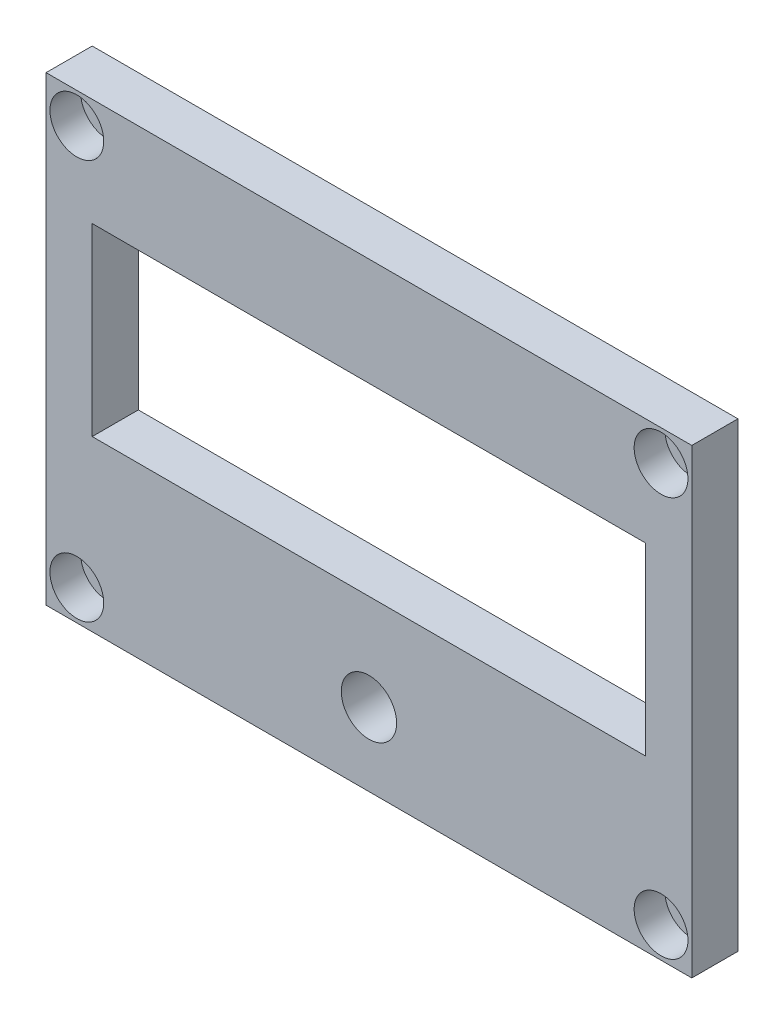
ISO-10303-21;
HEADER;
FILE_DESCRIPTION(('STEP AP214'),'2;1');
FILE_NAME('part.step','',(''),(''),'','','');
FILE_SCHEMA(('AUTOMOTIVE_DESIGN { 1 0 10303 214 1 1 1 1 }'));
ENDSEC;
DATA;
#1=APPLICATION_CONTEXT('core data for automotive mechanical design processes');
#2=APPLICATION_PROTOCOL_DEFINITION('international standard','automotive_design',2000,#1);
#3=PRODUCT_CONTEXT('',#1,'mechanical');
#4=PRODUCT('Part','Part','',(#3));
#5=PRODUCT_RELATED_PRODUCT_CATEGORY('part','',(#4));
#6=PRODUCT_DEFINITION_FORMATION('','',#4);
#7=PRODUCT_DEFINITION_CONTEXT('part definition',#1,'design');
#8=PRODUCT_DEFINITION('design','',#6,#7);
#9=PRODUCT_DEFINITION_SHAPE('','',#8);
#10=(LENGTH_UNIT() NAMED_UNIT(*) SI_UNIT(.MILLI.,.METRE.));
#11=(NAMED_UNIT(*) PLANE_ANGLE_UNIT() SI_UNIT($,.RADIAN.));
#12=(NAMED_UNIT(*) SI_UNIT($,.STERADIAN.) SOLID_ANGLE_UNIT());
#13=UNCERTAINTY_MEASURE_WITH_UNIT(LENGTH_MEASURE(1.E-05),#10,'distance_accuracy_value','');
#14=(GEOMETRIC_REPRESENTATION_CONTEXT(3) GLOBAL_UNCERTAINTY_ASSIGNED_CONTEXT((#13)) GLOBAL_UNIT_ASSIGNED_CONTEXT((#10,
#11,#12)) REPRESENTATION_CONTEXT('',''));
#15=CARTESIAN_POINT('',(0.,0.,0.));
#16=DIRECTION('',(0.,0.,1.));
#17=DIRECTION('',(1.,0.,0.));
#18=AXIS2_PLACEMENT_3D('',#15,#16,#17);
#19=CARTESIAN_POINT('',(-37.,30.,6.));
#20=DIRECTION('',(0.,-1.,0.));
#21=DIRECTION('',(0.,0.,-1.));
#22=AXIS2_PLACEMENT_3D('',#19,#20,#21);
#23=PLANE('',#22);
#24=DIRECTION('',(-1.,0.,0.));
#25=VECTOR('',#24,1.);
#26=CARTESIAN_POINT('',(-37.,30.,0.));
#27=LINE('',#26,#25);
#28=CARTESIAN_POINT('',(44.,30.,0.));
#29=VERTEX_POINT('',#28);
#30=CARTESIAN_POINT('',(-40.,30.,0.));
#31=VERTEX_POINT('',#30);
#32=EDGE_CURVE('E172',#29,#31,#27,.T.);
#33=ORIENTED_EDGE('',*,*,#32,.T.);
#34=DIRECTION('',(0.,0.,-1.));
#35=VECTOR('',#34,1.);
#36=CARTESIAN_POINT('',(-40.,30.,6.));
#37=LINE('',#36,#35);
#38=CARTESIAN_POINT('',(-40.,30.,6.));
#39=VERTEX_POINT('',#38);
#40=EDGE_CURVE('E44',#39,#31,#37,.T.);
#41=ORIENTED_EDGE('',*,*,#40,.F.);
#42=DIRECTION('',(-1.,0.,0.));
#43=VECTOR('',#42,1.);
#44=CARTESIAN_POINT('',(37.,30.,6.));
#45=LINE('',#44,#43);
#46=CARTESIAN_POINT('',(44.,30.,6.));
#47=VERTEX_POINT('',#46);
#48=EDGE_CURVE('E178',#47,#39,#45,.T.);
#49=ORIENTED_EDGE('',*,*,#48,.F.);
#50=DIRECTION('',(0.,0.,-1.));
#51=VECTOR('',#50,1.);
#52=CARTESIAN_POINT('',(44.,30.,6.));
#53=LINE('',#52,#51);
#54=EDGE_CURVE('E11',#47,#29,#53,.T.);
#55=ORIENTED_EDGE('',*,*,#54,.T.);
#56=EDGE_LOOP('',(#33,#41,#49,#55));
#57=FACE_BOUND('',#56,.T.);
#58=ADVANCED_FACE('F36',(#57),#23,.F.);
#59=CARTESIAN_POINT('',(-40.,-30.,6.));
#60=DIRECTION('',(1.,0.,0.));
#61=DIRECTION('',(0.,0.,-1.));
#62=AXIS2_PLACEMENT_3D('',#59,#60,#61);
#63=PLANE('',#62);
#64=DIRECTION('',(0.,-1.,0.));
#65=VECTOR('',#64,1.);
#66=CARTESIAN_POINT('',(-40.,-30.,0.));
#67=LINE('',#66,#65);
#68=CARTESIAN_POINT('',(-40.,-30.,0.));
#69=VERTEX_POINT('',#68);
#70=EDGE_CURVE('E188',#31,#69,#67,.T.);
#71=ORIENTED_EDGE('',*,*,#70,.T.);
#72=DIRECTION('',(0.,0.,-1.));
#73=VECTOR('',#72,1.);
#74=CARTESIAN_POINT('',(-40.,-30.,6.));
#75=LINE('',#74,#73);
#76=CARTESIAN_POINT('',(-40.,-30.,6.));
#77=VERTEX_POINT('',#76);
#78=EDGE_CURVE('E198',#77,#69,#75,.T.);
#79=ORIENTED_EDGE('',*,*,#78,.F.);
#80=DIRECTION('',(0.,-1.,0.));
#81=VECTOR('',#80,1.);
#82=CARTESIAN_POINT('',(-40.,30.,6.));
#83=LINE('',#82,#81);
#84=EDGE_CURVE('E181',#39,#77,#83,.T.);
#85=ORIENTED_EDGE('',*,*,#84,.F.);
#86=ORIENTED_EDGE('',*,*,#40,.T.);
#87=EDGE_LOOP('',(#71,#79,#85,#86));
#88=FACE_BOUND('',#87,.T.);
#89=ADVANCED_FACE('F246',(#88),#63,.F.);
#90=CARTESIAN_POINT('',(44.,-30.,6.));
#91=DIRECTION('',(0.,1.,0.));
#92=DIRECTION('',(0.,0.,1.));
#93=AXIS2_PLACEMENT_3D('',#90,#91,#92);
#94=PLANE('',#93);
#95=DIRECTION('',(1.,0.,0.));
#96=VECTOR('',#95,1.);
#97=CARTESIAN_POINT('',(44.,-30.,0.));
#98=LINE('',#97,#96);
#99=CARTESIAN_POINT('',(44.,-30.,0.));
#100=VERTEX_POINT('',#99);
#101=EDGE_CURVE('E191',#69,#100,#98,.T.);
#102=ORIENTED_EDGE('',*,*,#101,.T.);
#103=DIRECTION('',(0.,0.,-1.));
#104=VECTOR('',#103,1.);
#105=CARTESIAN_POINT('',(44.,-30.,6.));
#106=LINE('',#105,#104);
#107=CARTESIAN_POINT('',(44.,-30.,6.));
#108=VERTEX_POINT('',#107);
#109=EDGE_CURVE('E185',#108,#100,#106,.T.);
#110=ORIENTED_EDGE('',*,*,#109,.F.);
#111=DIRECTION('',(1.,0.,0.));
#112=VECTOR('',#111,1.);
#113=CARTESIAN_POINT('',(-37.,-30.,6.));
#114=LINE('',#113,#112);
#115=EDGE_CURVE('E183',#77,#108,#114,.T.);
#116=ORIENTED_EDGE('',*,*,#115,.F.);
#117=ORIENTED_EDGE('',*,*,#78,.T.);
#118=EDGE_LOOP('',(#102,#110,#116,#117));
#119=FACE_BOUND('',#118,.T.);
#120=ADVANCED_FACE('F248',(#119),#94,.F.);
#121=CARTESIAN_POINT('',(44.,-27.,6.));
#122=DIRECTION('',(-1.,0.,0.));
#123=DIRECTION('',(0.,0.,1.));
#124=AXIS2_PLACEMENT_3D('',#121,#122,#123);
#125=PLANE('',#124);
#126=DIRECTION('',(0.,1.,0.));
#127=VECTOR('',#126,1.);
#128=CARTESIAN_POINT('',(44.,-27.,0.));
#129=LINE('',#128,#127);
#130=EDGE_CURVE('E179',#100,#29,#129,.T.);
#131=ORIENTED_EDGE('',*,*,#130,.T.);
#132=ORIENTED_EDGE('',*,*,#54,.F.);
#133=DIRECTION('',(0.,1.,0.));
#134=VECTOR('',#133,1.);
#135=CARTESIAN_POINT('',(44.,30.,6.));
#136=LINE('',#135,#134);
#137=EDGE_CURVE('E175',#108,#47,#136,.T.);
#138=ORIENTED_EDGE('',*,*,#137,.F.);
#139=ORIENTED_EDGE('',*,*,#109,.T.);
#140=EDGE_LOOP('',(#131,#132,#138,#139));
#141=FACE_BOUND('',#140,.T.);
#142=ADVANCED_FACE('F233',(#141),#125,.F.);
#143=CARTESIAN_POINT('',(0.,0.,6.));
#144=DIRECTION('',(0.,0.,-1.));
#145=DIRECTION('',(-1.,0.,0.));
#146=AXIS2_PLACEMENT_3D('',#143,#144,#145);
#147=PLANE('',#146);
#148=CARTESIAN_POINT('',(1.99999999999999,-20.5,6.00000000000001));
#149=DIRECTION('',(0.,0.,-1.));
#150=DIRECTION('',(-1.,0.,0.));
#151=AXIS2_PLACEMENT_3D('',#148,#149,#150);
#152=CIRCLE('',#151,3.6);
#153=CARTESIAN_POINT('',(-1.6,-20.5,6.00000000000001));
#154=VERTEX_POINT('',#153);
#155=EDGE_CURVE('E146',#154,#154,#152,.F.);
#156=ORIENTED_EDGE('',*,*,#155,.F.);
#157=EDGE_LOOP('',(#156));
#158=FACE_BOUND('',#157,.T.);
#159=DIRECTION('',(1.,0.,0.));
#160=VECTOR('',#159,1.);
#161=CARTESIAN_POINT('',(-34.,-8.00000000000001,6.00000000000001));
#162=LINE('',#161,#160);
#163=CARTESIAN_POINT('',(-34.,-8.00000000000001,6.00000000000001));
#164=VERTEX_POINT('',#163);
#165=CARTESIAN_POINT('',(38.,-8.00000000000001,6.00000000000001));
#166=VERTEX_POINT('',#165);
#167=EDGE_CURVE('E570',#164,#166,#162,.T.);
#168=ORIENTED_EDGE('',*,*,#167,.F.);
#169=DIRECTION('',(0.,-1.,0.));
#170=VECTOR('',#169,1.);
#171=CARTESIAN_POINT('',(-34.,16.,6.00000000000001));
#172=LINE('',#171,#170);
#173=CARTESIAN_POINT('',(-34.,16.,6.00000000000001));
#174=VERTEX_POINT('',#173);
#175=EDGE_CURVE('E135',#174,#164,#172,.T.);
#176=ORIENTED_EDGE('',*,*,#175,.F.);
#177=DIRECTION('',(-1.,0.,0.));
#178=VECTOR('',#177,1.);
#179=CARTESIAN_POINT('',(1.99999999999999,16.,6.00000000000001));
#180=LINE('',#179,#178);
#181=CARTESIAN_POINT('',(38.,16.,6.));
#182=VERTEX_POINT('',#181);
#183=EDGE_CURVE('E132',#182,#174,#180,.T.);
#184=ORIENTED_EDGE('',*,*,#183,.F.);
#185=DIRECTION('',(0.,1.,0.));
#186=VECTOR('',#185,1.);
#187=CARTESIAN_POINT('',(38.,16.,6.00000000000001));
#188=LINE('',#187,#186);
#189=EDGE_CURVE('E108',#166,#182,#188,.T.);
#190=ORIENTED_EDGE('',*,*,#189,.F.);
#191=EDGE_LOOP('',(#168,#176,#184,#190));
#192=FACE_BOUND('',#191,.T.);
#193=CARTESIAN_POINT('',(-36.,-26.,6.));
#194=DIRECTION('',(0.,0.,1.));
#195=DIRECTION('',(-1.,0.,0.));
#196=AXIS2_PLACEMENT_3D('',#193,#194,#195);
#197=CIRCLE('',#196,3.5);
#198=CARTESIAN_POINT('',(-39.5,-26.,6.));
#199=VERTEX_POINT('',#198);
#200=EDGE_CURVE('E166',#199,#199,#197,.T.);
#201=ORIENTED_EDGE('',*,*,#200,.F.);
#202=EDGE_LOOP('',(#201));
#203=FACE_BOUND('',#202,.T.);
#204=CARTESIAN_POINT('',(40.,-26.,6.));
#205=DIRECTION('',(0.,0.,1.));
#206=DIRECTION('',(1.,0.,0.));
#207=AXIS2_PLACEMENT_3D('',#204,#205,#206);
#208=CIRCLE('',#207,3.5);
#209=CARTESIAN_POINT('',(43.5,-26.,6.));
#210=VERTEX_POINT('',#209);
#211=EDGE_CURVE('E160',#210,#210,#208,.T.);
#212=ORIENTED_EDGE('',*,*,#211,.F.);
#213=EDGE_LOOP('',(#212));
#214=FACE_BOUND('',#213,.T.);
#215=CARTESIAN_POINT('',(40.,26.,6.));
#216=DIRECTION('',(0.,0.,1.));
#217=DIRECTION('',(-1.,0.,0.));
#218=AXIS2_PLACEMENT_3D('',#215,#216,#217);
#219=CIRCLE('',#218,3.5);
#220=CARTESIAN_POINT('',(36.5,26.,6.));
#221=VERTEX_POINT('',#220);
#222=EDGE_CURVE('E154',#221,#221,#219,.T.);
#223=ORIENTED_EDGE('',*,*,#222,.F.);
#224=EDGE_LOOP('',(#223));
#225=FACE_BOUND('',#224,.T.);
#226=CARTESIAN_POINT('',(-36.,26.,6.));
#227=DIRECTION('',(0.,0.,1.));
#228=DIRECTION('',(1.,0.,0.));
#229=AXIS2_PLACEMENT_3D('',#226,#227,#228);
#230=CIRCLE('',#229,3.5);
#231=CARTESIAN_POINT('',(-32.5,26.,6.));
#232=VERTEX_POINT('',#231);
#233=EDGE_CURVE('E153',#232,#232,#230,.T.);
#234=ORIENTED_EDGE('',*,*,#233,.F.);
#235=EDGE_LOOP('',(#234));
#236=FACE_BOUND('',#235,.T.);
#237=ORIENTED_EDGE('',*,*,#137,.T.);
#238=ORIENTED_EDGE('',*,*,#48,.T.);
#239=ORIENTED_EDGE('',*,*,#84,.T.);
#240=ORIENTED_EDGE('',*,*,#115,.T.);
#241=EDGE_LOOP('',(#237,#238,#239,#240));
#242=FACE_BOUND('',#241,.T.);
#243=ADVANCED_FACE('F230',(#158,#192,#203,#214,#225,#236,#242),#147,.F.);
#244=CARTESIAN_POINT('',(0.,0.,0.));
#245=DIRECTION('',(0.,0.,-1.));
#246=DIRECTION('',(-1.,0.,0.));
#247=AXIS2_PLACEMENT_3D('',#244,#245,#246);
#248=PLANE('',#247);
#249=CARTESIAN_POINT('',(-36.,-12.,0.));
#250=DIRECTION('',(0.,0.,-1.));
#251=DIRECTION('',(-1.,0.,0.));
#252=AXIS2_PLACEMENT_3D('',#249,#250,#251);
#253=CIRCLE('',#252,1.5);
#254=CARTESIAN_POINT('',(-37.5,-12.,0.));
#255=VERTEX_POINT('',#254);
#256=EDGE_CURVE('E550',#255,#255,#253,.T.);
#257=ORIENTED_EDGE('',*,*,#256,.F.);
#258=EDGE_LOOP('',(#257));
#259=FACE_BOUND('',#258,.T.);
#260=CARTESIAN_POINT('',(40.,-12.,0.));
#261=DIRECTION('',(0.,0.,-1.));
#262=DIRECTION('',(-1.,0.,0.));
#263=AXIS2_PLACEMENT_3D('',#260,#261,#262);
#264=CIRCLE('',#263,1.5);
#265=CARTESIAN_POINT('',(38.5,-12.,0.));
#266=VERTEX_POINT('',#265);
#267=EDGE_CURVE('E549',#266,#266,#264,.T.);
#268=ORIENTED_EDGE('',*,*,#267,.F.);
#269=EDGE_LOOP('',(#268));
#270=FACE_BOUND('',#269,.T.);
#271=CARTESIAN_POINT('',(40.,20.,0.));
#272=DIRECTION('',(0.,0.,-1.));
#273=DIRECTION('',(-1.,0.,0.));
#274=AXIS2_PLACEMENT_3D('',#271,#272,#273);
#275=CIRCLE('',#274,1.5);
#276=CARTESIAN_POINT('',(38.5,20.,0.));
#277=VERTEX_POINT('',#276);
#278=EDGE_CURVE('E582',#277,#277,#275,.T.);
#279=ORIENTED_EDGE('',*,*,#278,.F.);
#280=EDGE_LOOP('',(#279));
#281=FACE_BOUND('',#280,.T.);
#282=CARTESIAN_POINT('',(-36.,20.,0.));
#283=DIRECTION('',(0.,0.,-1.));
#284=DIRECTION('',(-1.,0.,0.));
#285=AXIS2_PLACEMENT_3D('',#282,#283,#284);
#286=CIRCLE('',#285,1.5);
#287=CARTESIAN_POINT('',(-37.5,20.,0.));
#288=VERTEX_POINT('',#287);
#289=EDGE_CURVE('E561',#288,#288,#286,.T.);
#290=ORIENTED_EDGE('',*,*,#289,.F.);
#291=EDGE_LOOP('',(#290));
#292=FACE_BOUND('',#291,.T.);
#293=CARTESIAN_POINT('',(1.99999999999999,-20.5,0.));
#294=DIRECTION('',(0.,0.,-1.));
#295=DIRECTION('',(-1.,0.,0.));
#296=AXIS2_PLACEMENT_3D('',#293,#294,#295);
#297=CIRCLE('',#296,3.6);
#298=CARTESIAN_POINT('',(-1.6,-20.5,0.));
#299=VERTEX_POINT('',#298);
#300=EDGE_CURVE('E134',#299,#299,#297,.T.);
#301=ORIENTED_EDGE('',*,*,#300,.F.);
#302=EDGE_LOOP('',(#301));
#303=FACE_BOUND('',#302,.T.);
#304=DIRECTION('',(0.,1.,0.));
#305=VECTOR('',#304,1.);
#306=CARTESIAN_POINT('',(-34.,16.,0.));
#307=LINE('',#306,#305);
#308=CARTESIAN_POINT('',(-34.,-8.00000000000001,0.));
#309=VERTEX_POINT('',#308);
#310=CARTESIAN_POINT('',(-34.,16.,0.));
#311=VERTEX_POINT('',#310);
#312=EDGE_CURVE('E60',#309,#311,#307,.T.);
#313=ORIENTED_EDGE('',*,*,#312,.F.);
#314=DIRECTION('',(-1.,0.,0.));
#315=VECTOR('',#314,1.);
#316=CARTESIAN_POINT('',(-34.,-8.00000000000001,0.));
#317=LINE('',#316,#315);
#318=CARTESIAN_POINT('',(38.,-8.00000000000001,0.));
#319=VERTEX_POINT('',#318);
#320=EDGE_CURVE('E122',#319,#309,#317,.T.);
#321=ORIENTED_EDGE('',*,*,#320,.F.);
#322=DIRECTION('',(0.,-1.,0.));
#323=VECTOR('',#322,1.);
#324=CARTESIAN_POINT('',(38.,16.,0.));
#325=LINE('',#324,#323);
#326=CARTESIAN_POINT('',(38.,16.,0.));
#327=VERTEX_POINT('',#326);
#328=EDGE_CURVE('E105',#327,#319,#325,.T.);
#329=ORIENTED_EDGE('',*,*,#328,.F.);
#330=DIRECTION('',(1.,0.,0.));
#331=VECTOR('',#330,1.);
#332=CARTESIAN_POINT('',(1.99999999999999,16.,0.));
#333=LINE('',#332,#331);
#334=EDGE_CURVE('E113',#311,#327,#333,.T.);
#335=ORIENTED_EDGE('',*,*,#334,.F.);
#336=EDGE_LOOP('',(#313,#321,#329,#335));
#337=FACE_BOUND('',#336,.T.);
#338=CARTESIAN_POINT('',(-36.,-26.,0.));
#339=DIRECTION('',(0.,0.,-1.));
#340=DIRECTION('',(-1.,0.,0.));
#341=AXIS2_PLACEMENT_3D('',#338,#339,#340);
#342=CIRCLE('',#341,2.);
#343=CARTESIAN_POINT('',(-38.,-26.,0.));
#344=VERTEX_POINT('',#343);
#345=EDGE_CURVE('E143',#344,#344,#342,.F.);
#346=ORIENTED_EDGE('',*,*,#345,.T.);
#347=EDGE_LOOP('',(#346));
#348=FACE_BOUND('',#347,.T.);
#349=CARTESIAN_POINT('',(40.,-26.,0.));
#350=DIRECTION('',(0.,0.,-1.));
#351=DIRECTION('',(-1.,0.,0.));
#352=AXIS2_PLACEMENT_3D('',#349,#350,#351);
#353=CIRCLE('',#352,2.);
#354=CARTESIAN_POINT('',(38.,-26.,0.));
#355=VERTEX_POINT('',#354);
#356=EDGE_CURVE('E140',#355,#355,#353,.F.);
#357=ORIENTED_EDGE('',*,*,#356,.T.);
#358=EDGE_LOOP('',(#357));
#359=FACE_BOUND('',#358,.T.);
#360=CARTESIAN_POINT('',(40.,26.,0.));
#361=DIRECTION('',(0.,0.,-1.));
#362=DIRECTION('',(-1.,0.,0.));
#363=AXIS2_PLACEMENT_3D('',#360,#361,#362);
#364=CIRCLE('',#363,2.);
#365=CARTESIAN_POINT('',(38.,26.,0.));
#366=VERTEX_POINT('',#365);
#367=EDGE_CURVE('E136',#366,#366,#364,.F.);
#368=ORIENTED_EDGE('',*,*,#367,.T.);
#369=EDGE_LOOP('',(#368));
#370=FACE_BOUND('',#369,.T.);
#371=CARTESIAN_POINT('',(-36.,26.,0.));
#372=DIRECTION('',(0.,0.,-1.));
#373=DIRECTION('',(-1.,0.,0.));
#374=AXIS2_PLACEMENT_3D('',#371,#372,#373);
#375=CIRCLE('',#374,2.);
#376=CARTESIAN_POINT('',(-38.,26.,0.));
#377=VERTEX_POINT('',#376);
#378=EDGE_CURVE('E139',#377,#377,#375,.F.);
#379=ORIENTED_EDGE('',*,*,#378,.T.);
#380=EDGE_LOOP('',(#379));
#381=FACE_BOUND('',#380,.T.);
#382=ORIENTED_EDGE('',*,*,#32,.F.);
#383=ORIENTED_EDGE('',*,*,#130,.F.);
#384=ORIENTED_EDGE('',*,*,#101,.F.);
#385=ORIENTED_EDGE('',*,*,#70,.F.);
#386=EDGE_LOOP('',(#382,#383,#384,#385));
#387=FACE_BOUND('',#386,.T.);
#388=ADVANCED_FACE('F119',(#259,#270,#281,#292,#303,#337,#348,#359,#370,#381,#387),#248,.T.);
#389=CARTESIAN_POINT('',(-36.,26.,2.));
#390=DIRECTION('',(0.,0.,1.));
#391=DIRECTION('',(1.,0.,0.));
#392=AXIS2_PLACEMENT_3D('',#389,#390,#391);
#393=CYLINDRICAL_SURFACE('',#392,3.5);
#394=CARTESIAN_POINT('',(-36.,26.,2.));
#395=DIRECTION('',(0.,0.,1.));
#396=DIRECTION('',(1.,0.,0.));
#397=AXIS2_PLACEMENT_3D('',#394,#395,#396);
#398=CIRCLE('',#397,3.5);
#399=CARTESIAN_POINT('',(-32.5,26.,2.));
#400=VERTEX_POINT('',#399);
#401=EDGE_CURVE('E169',#400,#400,#398,.T.);
#402=ORIENTED_EDGE('',*,*,#401,.F.);
#403=EDGE_LOOP('',(#402));
#404=FACE_BOUND('',#403,.T.);
#405=ORIENTED_EDGE('',*,*,#233,.T.);
#406=EDGE_LOOP('',(#405));
#407=FACE_BOUND('',#406,.T.);
#408=ADVANCED_FACE('F221',(#404,#407),#393,.F.);
#409=CARTESIAN_POINT('',(-36.,26.,2.));
#410=DIRECTION('',(0.,0.,1.));
#411=DIRECTION('',(1.,0.,0.));
#412=AXIS2_PLACEMENT_3D('',#409,#410,#411);
#413=PLANE('',#412);
#414=CARTESIAN_POINT('',(-36.,26.,2.));
#415=DIRECTION('',(0.,0.,1.));
#416=DIRECTION('',(1.,0.,0.));
#417=AXIS2_PLACEMENT_3D('',#414,#415,#416);
#418=CIRCLE('',#417,2.);
#419=CARTESIAN_POINT('',(-34.,26.,2.));
#420=VERTEX_POINT('',#419);
#421=EDGE_CURVE('E39',#420,#420,#418,.T.);
#422=ORIENTED_EDGE('',*,*,#421,.F.);
#423=EDGE_LOOP('',(#422));
#424=FACE_BOUND('',#423,.T.);
#425=ORIENTED_EDGE('',*,*,#401,.T.);
#426=EDGE_LOOP('',(#425));
#427=FACE_BOUND('',#426,.T.);
#428=ADVANCED_FACE('F217',(#424,#427),#413,.T.);
#429=CARTESIAN_POINT('',(40.,26.,2.));
#430=DIRECTION('',(0.,0.,1.));
#431=DIRECTION('',(1.,0.,0.));
#432=AXIS2_PLACEMENT_3D('',#429,#430,#431);
#433=CYLINDRICAL_SURFACE('',#432,3.5);
#434=CARTESIAN_POINT('',(40.,26.,2.));
#435=DIRECTION('',(0.,0.,1.));
#436=DIRECTION('',(-1.,0.,0.));
#437=AXIS2_PLACEMENT_3D('',#434,#435,#436);
#438=CIRCLE('',#437,3.5);
#439=CARTESIAN_POINT('',(36.5,26.,2.));
#440=VERTEX_POINT('',#439);
#441=EDGE_CURVE('E150',#440,#440,#438,.T.);
#442=ORIENTED_EDGE('',*,*,#441,.F.);
#443=EDGE_LOOP('',(#442));
#444=FACE_BOUND('',#443,.T.);
#445=ORIENTED_EDGE('',*,*,#222,.T.);
#446=EDGE_LOOP('',(#445));
#447=FACE_BOUND('',#446,.T.);
#448=ADVANCED_FACE('F220',(#444,#447),#433,.F.);
#449=CARTESIAN_POINT('',(40.,26.,2.));
#450=DIRECTION('',(0.,0.,-1.));
#451=DIRECTION('',(-1.,0.,0.));
#452=AXIS2_PLACEMENT_3D('',#449,#450,#451);
#453=PLANE('',#452);
#454=CARTESIAN_POINT('',(40.,26.,2.));
#455=DIRECTION('',(0.,0.,-1.));
#456=DIRECTION('',(-1.,0.,0.));
#457=AXIS2_PLACEMENT_3D('',#454,#455,#456);
#458=CIRCLE('',#457,2.);
#459=CARTESIAN_POINT('',(38.,26.,2.));
#460=VERTEX_POINT('',#459);
#461=EDGE_CURVE('E207',#460,#460,#458,.T.);
#462=ORIENTED_EDGE('',*,*,#461,.T.);
#463=EDGE_LOOP('',(#462));
#464=FACE_BOUND('',#463,.T.);
#465=ORIENTED_EDGE('',*,*,#441,.T.);
#466=EDGE_LOOP('',(#465));
#467=FACE_BOUND('',#466,.T.);
#468=ADVANCED_FACE('F434',(#464,#467),#453,.F.);
#469=CARTESIAN_POINT('',(40.,-26.,2.));
#470=DIRECTION('',(0.,0.,1.));
#471=DIRECTION('',(1.,0.,0.));
#472=AXIS2_PLACEMENT_3D('',#469,#470,#471);
#473=CYLINDRICAL_SURFACE('',#472,3.5);
#474=CARTESIAN_POINT('',(40.,-26.,2.));
#475=DIRECTION('',(0.,0.,1.));
#476=DIRECTION('',(1.,0.,0.));
#477=AXIS2_PLACEMENT_3D('',#474,#475,#476);
#478=CIRCLE('',#477,3.5);
#479=CARTESIAN_POINT('',(43.5,-26.,2.));
#480=VERTEX_POINT('',#479);
#481=EDGE_CURVE('E157',#480,#480,#478,.T.);
#482=ORIENTED_EDGE('',*,*,#481,.F.);
#483=EDGE_LOOP('',(#482));
#484=FACE_BOUND('',#483,.T.);
#485=ORIENTED_EDGE('',*,*,#211,.T.);
#486=EDGE_LOOP('',(#485));
#487=FACE_BOUND('',#486,.T.);
#488=ADVANCED_FACE('F437',(#484,#487),#473,.F.);
#489=CARTESIAN_POINT('',(40.,-26.,2.));
#490=DIRECTION('',(0.,0.,1.));
#491=DIRECTION('',(1.,0.,0.));
#492=AXIS2_PLACEMENT_3D('',#489,#490,#491);
#493=PLANE('',#492);
#494=CARTESIAN_POINT('',(40.,-26.,2.));
#495=DIRECTION('',(0.,0.,1.));
#496=DIRECTION('',(1.,0.,0.));
#497=AXIS2_PLACEMENT_3D('',#494,#495,#496);
#498=CIRCLE('',#497,2.);
#499=CARTESIAN_POINT('',(42.,-26.,2.));
#500=VERTEX_POINT('',#499);
#501=EDGE_CURVE('E205',#500,#500,#498,.T.);
#502=ORIENTED_EDGE('',*,*,#501,.F.);
#503=EDGE_LOOP('',(#502));
#504=FACE_BOUND('',#503,.T.);
#505=ORIENTED_EDGE('',*,*,#481,.T.);
#506=EDGE_LOOP('',(#505));
#507=FACE_BOUND('',#506,.T.);
#508=ADVANCED_FACE('F441',(#504,#507),#493,.T.);
#509=CARTESIAN_POINT('',(-36.,-26.,2.));
#510=DIRECTION('',(0.,0.,1.));
#511=DIRECTION('',(1.,0.,0.));
#512=AXIS2_PLACEMENT_3D('',#509,#510,#511);
#513=CYLINDRICAL_SURFACE('',#512,3.5);
#514=CARTESIAN_POINT('',(-36.,-26.,2.));
#515=DIRECTION('',(0.,0.,1.));
#516=DIRECTION('',(-1.,0.,0.));
#517=AXIS2_PLACEMENT_3D('',#514,#515,#516);
#518=CIRCLE('',#517,3.5);
#519=CARTESIAN_POINT('',(-39.5,-26.,2.));
#520=VERTEX_POINT('',#519);
#521=EDGE_CURVE('E163',#520,#520,#518,.T.);
#522=ORIENTED_EDGE('',*,*,#521,.F.);
#523=EDGE_LOOP('',(#522));
#524=FACE_BOUND('',#523,.T.);
#525=ORIENTED_EDGE('',*,*,#200,.T.);
#526=EDGE_LOOP('',(#525));
#527=FACE_BOUND('',#526,.T.);
#528=ADVANCED_FACE('F444',(#524,#527),#513,.F.);
#529=CARTESIAN_POINT('',(-36.,-26.,2.));
#530=DIRECTION('',(0.,0.,-1.));
#531=DIRECTION('',(-1.,0.,0.));
#532=AXIS2_PLACEMENT_3D('',#529,#530,#531);
#533=PLANE('',#532);
#534=CARTESIAN_POINT('',(-36.,-26.,2.));
#535=DIRECTION('',(0.,0.,-1.));
#536=DIRECTION('',(-1.,0.,0.));
#537=AXIS2_PLACEMENT_3D('',#534,#535,#536);
#538=CIRCLE('',#537,2.);
#539=CARTESIAN_POINT('',(-38.,-26.,2.));
#540=VERTEX_POINT('',#539);
#541=EDGE_CURVE('E149',#540,#540,#538,.T.);
#542=ORIENTED_EDGE('',*,*,#541,.T.);
#543=EDGE_LOOP('',(#542));
#544=FACE_BOUND('',#543,.T.);
#545=ORIENTED_EDGE('',*,*,#521,.T.);
#546=EDGE_LOOP('',(#545));
#547=FACE_BOUND('',#546,.T.);
#548=ADVANCED_FACE('F431',(#544,#547),#533,.F.);
#549=CARTESIAN_POINT('',(-36.,-26.,-5.65685424949238));
#550=DIRECTION('',(0.,0.,1.));
#551=DIRECTION('',(1.,0.,0.));
#552=AXIS2_PLACEMENT_3D('',#549,#550,#551);
#553=CYLINDRICAL_SURFACE('',#552,2.);
#554=ORIENTED_EDGE('',*,*,#345,.F.);
#555=EDGE_LOOP('',(#554));
#556=FACE_BOUND('',#555,.T.);
#557=ORIENTED_EDGE('',*,*,#541,.F.);
#558=EDGE_LOOP('',(#557));
#559=FACE_BOUND('',#558,.T.);
#560=ADVANCED_FACE('F427',(#556,#559),#553,.F.);
#561=CARTESIAN_POINT('',(40.,-26.,-5.65685424949238));
#562=DIRECTION('',(0.,0.,1.));
#563=DIRECTION('',(1.,0.,0.));
#564=AXIS2_PLACEMENT_3D('',#561,#562,#563);
#565=CYLINDRICAL_SURFACE('',#564,2.);
#566=ORIENTED_EDGE('',*,*,#501,.T.);
#567=EDGE_LOOP('',(#566));
#568=FACE_BOUND('',#567,.T.);
#569=ORIENTED_EDGE('',*,*,#356,.F.);
#570=EDGE_LOOP('',(#569));
#571=FACE_BOUND('',#570,.T.);
#572=ADVANCED_FACE('F423',(#568,#571),#565,.F.);
#573=CARTESIAN_POINT('',(40.,26.,-5.65685424949238));
#574=DIRECTION('',(0.,0.,1.));
#575=DIRECTION('',(1.,0.,0.));
#576=AXIS2_PLACEMENT_3D('',#573,#574,#575);
#577=CYLINDRICAL_SURFACE('',#576,2.);
#578=ORIENTED_EDGE('',*,*,#367,.F.);
#579=EDGE_LOOP('',(#578));
#580=FACE_BOUND('',#579,.T.);
#581=ORIENTED_EDGE('',*,*,#461,.F.);
#582=EDGE_LOOP('',(#581));
#583=FACE_BOUND('',#582,.T.);
#584=ADVANCED_FACE('F420',(#580,#583),#577,.F.);
#585=CARTESIAN_POINT('',(-36.,26.,-5.65685424949238));
#586=DIRECTION('',(0.,0.,1.));
#587=DIRECTION('',(1.,0.,0.));
#588=AXIS2_PLACEMENT_3D('',#585,#586,#587);
#589=CYLINDRICAL_SURFACE('',#588,2.);
#590=ORIENTED_EDGE('',*,*,#421,.T.);
#591=EDGE_LOOP('',(#590));
#592=FACE_BOUND('',#591,.T.);
#593=ORIENTED_EDGE('',*,*,#378,.F.);
#594=EDGE_LOOP('',(#593));
#595=FACE_BOUND('',#594,.T.);
#596=ADVANCED_FACE('F214',(#592,#595),#589,.F.);
#597=CARTESIAN_POINT('',(-34.,16.,81.8946638440411));
#598=DIRECTION('',(-1.,0.,0.));
#599=DIRECTION('',(0.,0.,1.));
#600=AXIS2_PLACEMENT_3D('',#597,#598,#599);
#601=PLANE('',#600);
#602=ORIENTED_EDGE('',*,*,#175,.T.);
#603=DIRECTION('',(0.,0.,-1.));
#604=VECTOR('',#603,1.);
#605=CARTESIAN_POINT('',(-34.,-8.00000000000001,81.8946638440411));
#606=LINE('',#605,#604);
#607=EDGE_CURVE('E129',#164,#309,#606,.T.);
#608=ORIENTED_EDGE('',*,*,#607,.T.);
#609=ORIENTED_EDGE('',*,*,#312,.T.);
#610=DIRECTION('',(0.,0.,-1.));
#611=VECTOR('',#610,1.);
#612=CARTESIAN_POINT('',(-34.,16.,81.8946638440411));
#613=LINE('',#612,#611);
#614=EDGE_CURVE('E115',#174,#311,#613,.T.);
#615=ORIENTED_EDGE('',*,*,#614,.F.);
#616=EDGE_LOOP('',(#602,#608,#609,#615));
#617=FACE_BOUND('',#616,.T.);
#618=ADVANCED_FACE('F287',(#617),#601,.F.);
#619=CARTESIAN_POINT('',(-34.,-8.00000000000001,81.8946638440411));
#620=DIRECTION('',(0.,-1.,0.));
#621=DIRECTION('',(0.,0.,-1.));
#622=AXIS2_PLACEMENT_3D('',#619,#620,#621);
#623=PLANE('',#622);
#624=ORIENTED_EDGE('',*,*,#167,.T.);
#625=DIRECTION('',(0.,0.,-1.));
#626=VECTOR('',#625,1.);
#627=CARTESIAN_POINT('',(38.,-8.00000000000001,81.8946638440411));
#628=LINE('',#627,#626);
#629=EDGE_CURVE('E110',#166,#319,#628,.T.);
#630=ORIENTED_EDGE('',*,*,#629,.T.);
#631=ORIENTED_EDGE('',*,*,#320,.T.);
#632=ORIENTED_EDGE('',*,*,#607,.F.);
#633=EDGE_LOOP('',(#624,#630,#631,#632));
#634=FACE_BOUND('',#633,.T.);
#635=ADVANCED_FACE('F292',(#634),#623,.F.);
#636=CARTESIAN_POINT('',(38.,16.,81.8946638440411));
#637=DIRECTION('',(1.,0.,0.));
#638=DIRECTION('',(0.,0.,-1.));
#639=AXIS2_PLACEMENT_3D('',#636,#637,#638);
#640=PLANE('',#639);
#641=ORIENTED_EDGE('',*,*,#189,.T.);
#642=DIRECTION('',(0.,0.,-1.));
#643=VECTOR('',#642,1.);
#644=CARTESIAN_POINT('',(38.,16.,81.8946638440411));
#645=LINE('',#644,#643);
#646=EDGE_CURVE('E52',#182,#327,#645,.T.);
#647=ORIENTED_EDGE('',*,*,#646,.T.);
#648=ORIENTED_EDGE('',*,*,#328,.T.);
#649=ORIENTED_EDGE('',*,*,#629,.F.);
#650=EDGE_LOOP('',(#641,#647,#648,#649));
#651=FACE_BOUND('',#650,.T.);
#652=ADVANCED_FACE('F102',(#651),#640,.F.);
#653=CARTESIAN_POINT('',(1.99999999999999,16.,81.8946638440411));
#654=DIRECTION('',(0.,1.,0.));
#655=DIRECTION('',(-1.,0.,0.));
#656=AXIS2_PLACEMENT_3D('',#653,#654,#655);
#657=PLANE('',#656);
#658=ORIENTED_EDGE('',*,*,#183,.T.);
#659=ORIENTED_EDGE('',*,*,#614,.T.);
#660=ORIENTED_EDGE('',*,*,#334,.T.);
#661=ORIENTED_EDGE('',*,*,#646,.F.);
#662=EDGE_LOOP('',(#658,#659,#660,#661));
#663=FACE_BOUND('',#662,.T.);
#664=ADVANCED_FACE('F114',(#663),#657,.F.);
#665=CARTESIAN_POINT('',(1.99999999999999,-20.5,81.8946638440411));
#666=DIRECTION('',(0.,0.,-1.));
#667=DIRECTION('',(-1.,0.,0.));
#668=AXIS2_PLACEMENT_3D('',#665,#666,#667);
#669=CYLINDRICAL_SURFACE('',#668,3.6);
#670=ORIENTED_EDGE('',*,*,#155,.T.);
#671=EDGE_LOOP('',(#670));
#672=FACE_BOUND('',#671,.T.);
#673=ORIENTED_EDGE('',*,*,#300,.T.);
#674=EDGE_LOOP('',(#673));
#675=FACE_BOUND('',#674,.T.);
#676=ADVANCED_FACE('F321',(#672,#675),#669,.F.);
#677=CARTESIAN_POINT('',(-36.,20.,4.));
#678=DIRECTION('',(0.,0.,-1.));
#679=DIRECTION('',(-1.,0.,0.));
#680=AXIS2_PLACEMENT_3D('',#677,#678,#679);
#681=CYLINDRICAL_SURFACE('',#680,1.5);
#682=CARTESIAN_POINT('',(-36.,20.,4.));
#683=DIRECTION('',(0.,0.,-1.));
#684=DIRECTION('',(-1.,0.,0.));
#685=AXIS2_PLACEMENT_3D('',#682,#683,#684);
#686=CIRCLE('',#685,1.5);
#687=CARTESIAN_POINT('',(-37.5,20.,4.));
#688=VERTEX_POINT('',#687);
#689=EDGE_CURVE('E117',#688,#688,#686,.T.);
#690=ORIENTED_EDGE('',*,*,#689,.F.);
#691=EDGE_LOOP('',(#690));
#692=FACE_BOUND('',#691,.T.);
#693=ORIENTED_EDGE('',*,*,#289,.T.);
#694=EDGE_LOOP('',(#693));
#695=FACE_BOUND('',#694,.T.);
#696=ADVANCED_FACE('F329',(#692,#695),#681,.F.);
#697=CARTESIAN_POINT('',(-36.,20.,4.));
#698=DIRECTION('',(0.,0.,-1.));
#699=DIRECTION('',(-1.,0.,0.));
#700=AXIS2_PLACEMENT_3D('',#697,#698,#699);
#701=PLANE('',#700);
#702=ORIENTED_EDGE('',*,*,#689,.T.);
#703=EDGE_LOOP('',(#702));
#704=FACE_BOUND('',#703,.T.);
#705=ADVANCED_FACE('F344',(#704),#701,.T.);
#706=CARTESIAN_POINT('',(40.,20.,4.));
#707=DIRECTION('',(0.,0.,-1.));
#708=DIRECTION('',(-1.,0.,0.));
#709=AXIS2_PLACEMENT_3D('',#706,#707,#708);
#710=CYLINDRICAL_SURFACE('',#709,1.5);
#711=CARTESIAN_POINT('',(40.,20.,4.));
#712=DIRECTION('',(0.,0.,-1.));
#713=DIRECTION('',(-1.,0.,0.));
#714=AXIS2_PLACEMENT_3D('',#711,#712,#713);
#715=CIRCLE('',#714,1.5);
#716=CARTESIAN_POINT('',(38.5,20.,4.));
#717=VERTEX_POINT('',#716);
#718=EDGE_CURVE('E564',#717,#717,#715,.T.);
#719=ORIENTED_EDGE('',*,*,#718,.F.);
#720=EDGE_LOOP('',(#719));
#721=FACE_BOUND('',#720,.T.);
#722=ORIENTED_EDGE('',*,*,#278,.T.);
#723=EDGE_LOOP('',(#722));
#724=FACE_BOUND('',#723,.T.);
#725=ADVANCED_FACE('F354',(#721,#724),#710,.F.);
#726=CARTESIAN_POINT('',(40.,20.,4.));
#727=DIRECTION('',(0.,0.,-1.));
#728=DIRECTION('',(-1.,0.,0.));
#729=AXIS2_PLACEMENT_3D('',#726,#727,#728);
#730=PLANE('',#729);
#731=ORIENTED_EDGE('',*,*,#718,.T.);
#732=EDGE_LOOP('',(#731));
#733=FACE_BOUND('',#732,.T.);
#734=ADVANCED_FACE('F364',(#733),#730,.T.);
#735=CARTESIAN_POINT('',(40.,-12.,4.));
#736=DIRECTION('',(0.,0.,-1.));
#737=DIRECTION('',(-1.,0.,0.));
#738=AXIS2_PLACEMENT_3D('',#735,#736,#737);
#739=CYLINDRICAL_SURFACE('',#738,1.5);
#740=CARTESIAN_POINT('',(40.,-12.,4.));
#741=DIRECTION('',(0.,0.,-1.));
#742=DIRECTION('',(-1.,0.,0.));
#743=AXIS2_PLACEMENT_3D('',#740,#741,#742);
#744=CIRCLE('',#743,1.5);
#745=CARTESIAN_POINT('',(38.5,-12.,4.));
#746=VERTEX_POINT('',#745);
#747=EDGE_CURVE('E553',#746,#746,#744,.T.);
#748=ORIENTED_EDGE('',*,*,#747,.F.);
#749=EDGE_LOOP('',(#748));
#750=FACE_BOUND('',#749,.T.);
#751=ORIENTED_EDGE('',*,*,#267,.T.);
#752=EDGE_LOOP('',(#751));
#753=FACE_BOUND('',#752,.T.);
#754=ADVANCED_FACE('F374',(#750,#753),#739,.F.);
#755=CARTESIAN_POINT('',(40.,-12.,4.));
#756=DIRECTION('',(0.,0.,-1.));
#757=DIRECTION('',(-1.,0.,0.));
#758=AXIS2_PLACEMENT_3D('',#755,#756,#757);
#759=PLANE('',#758);
#760=ORIENTED_EDGE('',*,*,#747,.T.);
#761=EDGE_LOOP('',(#760));
#762=FACE_BOUND('',#761,.T.);
#763=ADVANCED_FACE('F384',(#762),#759,.T.);
#764=CARTESIAN_POINT('',(-36.,-12.,4.));
#765=DIRECTION('',(0.,0.,-1.));
#766=DIRECTION('',(-1.,0.,0.));
#767=AXIS2_PLACEMENT_3D('',#764,#765,#766);
#768=CYLINDRICAL_SURFACE('',#767,1.5);
#769=CARTESIAN_POINT('',(-36.,-12.,4.));
#770=DIRECTION('',(0.,0.,-1.));
#771=DIRECTION('',(-1.,0.,0.));
#772=AXIS2_PLACEMENT_3D('',#769,#770,#771);
#773=CIRCLE('',#772,1.5);
#774=CARTESIAN_POINT('',(-37.5,-12.,4.));
#775=VERTEX_POINT('',#774);
#776=EDGE_CURVE('E548',#775,#775,#773,.T.);
#777=ORIENTED_EDGE('',*,*,#776,.F.);
#778=EDGE_LOOP('',(#777));
#779=FACE_BOUND('',#778,.T.);
#780=ORIENTED_EDGE('',*,*,#256,.T.);
#781=EDGE_LOOP('',(#780));
#782=FACE_BOUND('',#781,.T.);
#783=ADVANCED_FACE('F394',(#779,#782),#768,.F.);
#784=CARTESIAN_POINT('',(-36.,-12.,4.));
#785=DIRECTION('',(0.,0.,-1.));
#786=DIRECTION('',(-1.,0.,0.));
#787=AXIS2_PLACEMENT_3D('',#784,#785,#786);
#788=PLANE('',#787);
#789=ORIENTED_EDGE('',*,*,#776,.T.);
#790=EDGE_LOOP('',(#789));
#791=FACE_BOUND('',#790,.T.);
#792=ADVANCED_FACE('F404',(#791),#788,.T.);
#793=CLOSED_SHELL('',(#58,#89,#120,#142,#243,#388,#408,#428,#448,#468,#488,#508,#528,#548,#560,
#572,#584,#596,#618,#635,#652,#664,#676,#696,#705,#725,#734,#754,#763,#783,#792));
#794=MANIFOLD_SOLID_BREP('B2',#793);
#795=ADVANCED_BREP_SHAPE_REPRESENTATION('',(#18,#794),#14);
#796=SHAPE_DEFINITION_REPRESENTATION(#9,#795);
ENDSEC;
END-ISO-10303-21;
